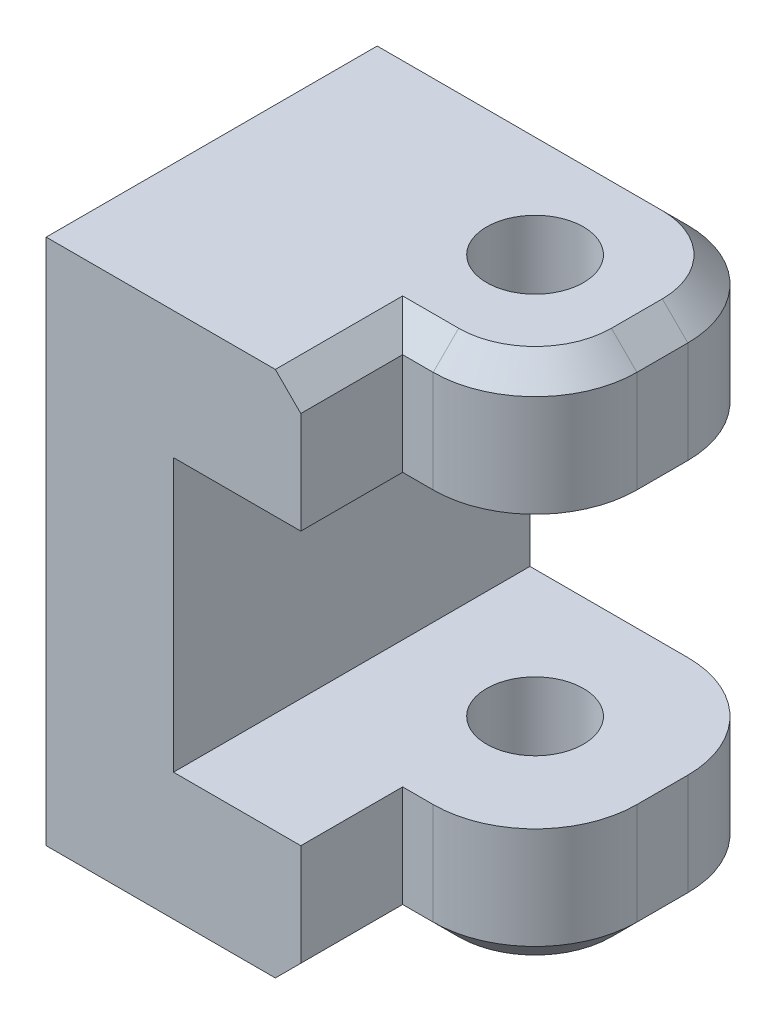
ISO-10303-21;
HEADER;
FILE_DESCRIPTION(('STEP AP214'),'2;1');
FILE_NAME('part.step','',(''),(''),'','','');
FILE_SCHEMA(('AUTOMOTIVE_DESIGN { 1 0 10303 214 1 1 1 1 }'));
ENDSEC;
DATA;
#1=APPLICATION_CONTEXT('core data for automotive mechanical design processes');
#2=APPLICATION_PROTOCOL_DEFINITION('international standard','automotive_design',2000,#1);
#3=PRODUCT_CONTEXT('',#1,'mechanical');
#4=PRODUCT('Part','Part','',(#3));
#5=PRODUCT_RELATED_PRODUCT_CATEGORY('part','',(#4));
#6=PRODUCT_DEFINITION_FORMATION('','',#4);
#7=PRODUCT_DEFINITION_CONTEXT('part definition',#1,'design');
#8=PRODUCT_DEFINITION('design','',#6,#7);
#9=PRODUCT_DEFINITION_SHAPE('','',#8);
#10=(LENGTH_UNIT() NAMED_UNIT(*) SI_UNIT(.MILLI.,.METRE.));
#11=(NAMED_UNIT(*) PLANE_ANGLE_UNIT() SI_UNIT($,.RADIAN.));
#12=(NAMED_UNIT(*) SI_UNIT($,.STERADIAN.) SOLID_ANGLE_UNIT());
#13=UNCERTAINTY_MEASURE_WITH_UNIT(LENGTH_MEASURE(1.E-05),#10,'distance_accuracy_value','');
#14=(GEOMETRIC_REPRESENTATION_CONTEXT(3) GLOBAL_UNCERTAINTY_ASSIGNED_CONTEXT((#13)) GLOBAL_UNIT_ASSIGNED_CONTEXT((#10,
#11,#12)) REPRESENTATION_CONTEXT('',''));
#15=CARTESIAN_POINT('',(0.,0.,0.));
#16=DIRECTION('',(0.,0.,1.));
#17=DIRECTION('',(1.,0.,0.));
#18=AXIS2_PLACEMENT_3D('',#15,#16,#17);
#19=CARTESIAN_POINT('',(24.95,9.35000000000001,0.));
#20=DIRECTION('',(-0.707106781186545,-0.70710678118655,0.));
#21=DIRECTION('',(0.,0.,1.));
#22=AXIS2_PLACEMENT_3D('',#19,#20,#21);
#23=PLANE('',#22);
#24=DIRECTION('',(-0.707106781186547,0.707106781186547,0.));
#25=VECTOR('',#24,1.);
#26=CARTESIAN_POINT('',(24.95,9.35000000000001,4.));
#27=LINE('',#26,#25);
#28=CARTESIAN_POINT('',(24.95,9.35000000000001,4.));
#29=VERTEX_POINT('',#28);
#30=CARTESIAN_POINT('',(23.95,10.35,4.));
#31=VERTEX_POINT('',#30);
#32=EDGE_CURVE('E355',#29,#31,#27,.T.);
#33=ORIENTED_EDGE('',*,*,#32,.T.);
#34=DIRECTION('',(0.,0.,-1.));
#35=VECTOR('',#34,1.);
#36=CARTESIAN_POINT('',(23.95,10.35,5.));
#37=LINE('',#36,#35);
#38=CARTESIAN_POINT('',(23.95,10.35,6.));
#39=VERTEX_POINT('',#38);
#40=EDGE_CURVE('E307',#39,#31,#37,.T.);
#41=ORIENTED_EDGE('',*,*,#40,.F.);
#42=DIRECTION('',(-0.70710678118655,0.707106781186545,0.));
#43=VECTOR('',#42,1.);
#44=CARTESIAN_POINT('',(24.95,9.35000000000001,6.));
#45=LINE('',#44,#43);
#46=CARTESIAN_POINT('',(24.95,9.35000000000001,6.));
#47=VERTEX_POINT('',#46);
#48=EDGE_CURVE('E352',#47,#39,#45,.T.);
#49=ORIENTED_EDGE('',*,*,#48,.F.);
#50=DIRECTION('',(0.,0.,1.));
#51=VECTOR('',#50,1.);
#52=CARTESIAN_POINT('',(24.95,9.35000000000001,0.));
#53=LINE('',#52,#51);
#54=EDGE_CURVE('E316',#29,#47,#53,.T.);
#55=ORIENTED_EDGE('',*,*,#54,.F.);
#56=EDGE_LOOP('',(#33,#41,#49,#55));
#57=FACE_BOUND('',#56,.T.);
#58=ADVANCED_FACE('F35',(#57),#23,.F.);
#59=CARTESIAN_POINT('',(20.95,10.35,6.));
#60=DIRECTION('',(0.,-1.,0.));
#61=DIRECTION('',(0.,0.,-1.));
#62=AXIS2_PLACEMENT_3D('',#59,#60,#61);
#63=CONICAL_SURFACE('',#62,3.00000000000001,0.785398163397448);
#64=ORIENTED_EDGE('',*,*,#48,.T.);
#65=CARTESIAN_POINT('',(20.95,10.35,6.));
#66=DIRECTION('',(0.,-1.,0.));
#67=DIRECTION('',(0.,0.,-1.));
#68=AXIS2_PLACEMENT_3D('',#65,#66,#67);
#69=CIRCLE('',#68,3.00000000000001);
#70=CARTESIAN_POINT('',(20.95,10.35,9.00000000000001));
#71=VERTEX_POINT('',#70);
#72=EDGE_CURVE('E305',#71,#39,#69,.F.);
#73=ORIENTED_EDGE('',*,*,#72,.F.);
#74=DIRECTION('',(0.,0.707106781186547,-0.707106781186547));
#75=VECTOR('',#74,1.);
#76=CARTESIAN_POINT('',(20.95,9.35000000000001,10.));
#77=LINE('',#76,#75);
#78=CARTESIAN_POINT('',(20.95,9.35000000000001,10.));
#79=VERTEX_POINT('',#78);
#80=EDGE_CURVE('E349',#79,#71,#77,.T.);
#81=ORIENTED_EDGE('',*,*,#80,.F.);
#82=CARTESIAN_POINT('',(20.95,9.35000000000001,6.));
#83=DIRECTION('',(0.,-1.,0.));
#84=DIRECTION('',(0.,0.,-1.));
#85=AXIS2_PLACEMENT_3D('',#82,#83,#84);
#86=CIRCLE('',#85,4.);
#87=EDGE_CURVE('E314',#47,#79,#86,.T.);
#88=ORIENTED_EDGE('',*,*,#87,.F.);
#89=EDGE_LOOP('',(#64,#73,#81,#88));
#90=FACE_BOUND('',#89,.T.);
#91=ADVANCED_FACE('F392',(#90),#63,.T.);
#92=CARTESIAN_POINT('',(20.95,-10.35,6.));
#93=DIRECTION('',(0.,1.,0.));
#94=DIRECTION('',(0.,0.,1.));
#95=AXIS2_PLACEMENT_3D('',#92,#93,#94);
#96=CONICAL_SURFACE('',#95,2.99999999999999,0.785398163397452);
#97=DIRECTION('',(0.,-0.707106781186545,-0.70710678118655));
#98=VECTOR('',#97,1.);
#99=CARTESIAN_POINT('',(20.95,-9.35,10.));
#100=LINE('',#99,#98);
#101=CARTESIAN_POINT('',(20.95,-9.35,10.));
#102=VERTEX_POINT('',#101);
#103=CARTESIAN_POINT('',(20.95,-10.35,8.99999999999999));
#104=VERTEX_POINT('',#103);
#105=EDGE_CURVE('E370',#102,#104,#100,.T.);
#106=ORIENTED_EDGE('',*,*,#105,.T.);
#107=CARTESIAN_POINT('',(20.95,-10.35,6.));
#108=DIRECTION('',(0.,1.,0.));
#109=DIRECTION('',(0.,0.,1.));
#110=AXIS2_PLACEMENT_3D('',#107,#108,#109);
#111=CIRCLE('',#110,2.99999999999999);
#112=CARTESIAN_POINT('',(23.95,-10.35,6.));
#113=VERTEX_POINT('',#112);
#114=EDGE_CURVE('E330',#113,#104,#111,.F.);
#115=ORIENTED_EDGE('',*,*,#114,.F.);
#116=DIRECTION('',(-0.70710678118655,-0.707106781186545,0.));
#117=VECTOR('',#116,1.);
#118=CARTESIAN_POINT('',(24.95,-9.35,6.));
#119=LINE('',#118,#117);
#120=CARTESIAN_POINT('',(24.95,-9.35,6.));
#121=VERTEX_POINT('',#120);
#122=EDGE_CURVE('E367',#121,#113,#119,.T.);
#123=ORIENTED_EDGE('',*,*,#122,.F.);
#124=CARTESIAN_POINT('',(20.95,-9.35,6.));
#125=DIRECTION('',(0.,1.,0.));
#126=DIRECTION('',(0.,0.,1.));
#127=AXIS2_PLACEMENT_3D('',#124,#125,#126);
#128=CIRCLE('',#127,4.);
#129=EDGE_CURVE('E340',#102,#121,#128,.T.);
#130=ORIENTED_EDGE('',*,*,#129,.F.);
#131=EDGE_LOOP('',(#106,#115,#123,#130));
#132=FACE_BOUND('',#131,.T.);
#133=ADVANCED_FACE('F463',(#132),#96,.T.);
#134=CARTESIAN_POINT('',(24.95,-9.35,0.));
#135=DIRECTION('',(0.707106781186546,-0.707106781186549,0.));
#136=DIRECTION('',(0.,0.,1.));
#137=AXIS2_PLACEMENT_3D('',#134,#135,#136);
#138=PLANE('',#137);
#139=ORIENTED_EDGE('',*,*,#122,.T.);
#140=DIRECTION('',(0.,0.,1.));
#141=VECTOR('',#140,1.);
#142=CARTESIAN_POINT('',(23.95,-10.35,6.));
#143=LINE('',#142,#141);
#144=CARTESIAN_POINT('',(23.95,-10.35,4.));
#145=VERTEX_POINT('',#144);
#146=EDGE_CURVE('E332',#145,#113,#143,.T.);
#147=ORIENTED_EDGE('',*,*,#146,.F.);
#148=DIRECTION('',(-0.707106781186549,-0.707106781186546,0.));
#149=VECTOR('',#148,1.);
#150=CARTESIAN_POINT('',(24.95,-9.35,4.));
#151=LINE('',#150,#149);
#152=CARTESIAN_POINT('',(24.95,-9.35,4.));
#153=VERTEX_POINT('',#152);
#154=EDGE_CURVE('E364',#153,#145,#151,.T.);
#155=ORIENTED_EDGE('',*,*,#154,.F.);
#156=DIRECTION('',(0.,0.,-1.));
#157=VECTOR('',#156,1.);
#158=CARTESIAN_POINT('',(24.95,-9.35,4.));
#159=LINE('',#158,#157);
#160=EDGE_CURVE('E59',#121,#153,#159,.T.);
#161=ORIENTED_EDGE('',*,*,#160,.F.);
#162=EDGE_LOOP('',(#139,#147,#155,#161));
#163=FACE_BOUND('',#162,.T.);
#164=ADVANCED_FACE('F456',(#163),#138,.T.);
#165=CARTESIAN_POINT('',(20.95,0.,6.));
#166=DIRECTION('',(0.,-1.,0.));
#167=DIRECTION('',(1.,0.,0.));
#168=AXIS2_PLACEMENT_3D('',#165,#166,#167);
#169=CYLINDRICAL_SURFACE('',#168,4.);
#170=DIRECTION('',(0.,-1.,0.));
#171=VECTOR('',#170,1.);
#172=CARTESIAN_POINT('',(24.95,0.,6.));
#173=LINE('',#172,#171);
#174=CARTESIAN_POINT('',(24.95,5.35,6.));
#175=VERTEX_POINT('',#174);
#176=EDGE_CURVE('E274',#47,#175,#173,.T.);
#177=ORIENTED_EDGE('',*,*,#176,.F.);
#178=ORIENTED_EDGE('',*,*,#87,.T.);
#179=DIRECTION('',(0.,-1.,0.));
#180=VECTOR('',#179,1.);
#181=CARTESIAN_POINT('',(20.95,10.35,10.));
#182=LINE('',#181,#180);
#183=CARTESIAN_POINT('',(20.95,5.35,10.));
#184=VERTEX_POINT('',#183);
#185=EDGE_CURVE('E280',#184,#79,#182,.F.);
#186=ORIENTED_EDGE('',*,*,#185,.F.);
#187=CARTESIAN_POINT('',(20.95,5.35,6.));
#188=DIRECTION('',(0.,1.,0.));
#189=DIRECTION('',(0.,0.,1.));
#190=AXIS2_PLACEMENT_3D('',#187,#188,#189);
#191=CIRCLE('',#190,4.);
#192=EDGE_CURVE('E278',#175,#184,#191,.F.);
#193=ORIENTED_EDGE('',*,*,#192,.F.);
#194=EDGE_LOOP('',(#177,#178,#186,#193));
#195=FACE_BOUND('',#194,.T.);
#196=ADVANCED_FACE('F454',(#195),#169,.T.);
#197=CARTESIAN_POINT('',(24.95,0.,0.));
#198=DIRECTION('',(-1.,0.,0.));
#199=DIRECTION('',(0.,-1.,0.));
#200=AXIS2_PLACEMENT_3D('',#197,#198,#199);
#201=PLANE('',#200);
#202=DIRECTION('',(0.,1.,0.));
#203=VECTOR('',#202,1.);
#204=CARTESIAN_POINT('',(24.95,0.,4.));
#205=LINE('',#204,#203);
#206=CARTESIAN_POINT('',(24.95,5.35,4.));
#207=VERTEX_POINT('',#206);
#208=EDGE_CURVE('E269',#207,#29,#205,.T.);
#209=ORIENTED_EDGE('',*,*,#208,.T.);
#210=ORIENTED_EDGE('',*,*,#54,.T.);
#211=ORIENTED_EDGE('',*,*,#176,.T.);
#212=DIRECTION('',(0.,0.,-1.));
#213=VECTOR('',#212,1.);
#214=CARTESIAN_POINT('',(24.95,5.35,0.));
#215=LINE('',#214,#213);
#216=EDGE_CURVE('E256',#175,#207,#215,.T.);
#217=ORIENTED_EDGE('',*,*,#216,.T.);
#218=EDGE_LOOP('',(#209,#210,#211,#217));
#219=FACE_BOUND('',#218,.T.);
#220=ADVANCED_FACE('F448',(#219),#201,.F.);
#221=CARTESIAN_POINT('',(20.95,0.,4.));
#222=DIRECTION('',(0.,1.,0.));
#223=DIRECTION('',(-1.,0.,0.));
#224=AXIS2_PLACEMENT_3D('',#221,#222,#223);
#225=CYLINDRICAL_SURFACE('',#224,4.);
#226=DIRECTION('',(0.,1.,0.));
#227=VECTOR('',#226,1.);
#228=CARTESIAN_POINT('',(20.95,0.,0.));
#229=LINE('',#228,#227);
#230=CARTESIAN_POINT('',(20.95,9.35000000000001,0.));
#231=VERTEX_POINT('',#230);
#232=CARTESIAN_POINT('',(20.95,5.35,0.));
#233=VERTEX_POINT('',#232);
#234=EDGE_CURVE('E286',#231,#233,#229,.F.);
#235=ORIENTED_EDGE('',*,*,#234,.F.);
#236=CARTESIAN_POINT('',(20.95,9.35000000000001,4.));
#237=DIRECTION('',(0.,-1.,0.));
#238=DIRECTION('',(0.,0.,-1.));
#239=AXIS2_PLACEMENT_3D('',#236,#237,#238);
#240=CIRCLE('',#239,4.);
#241=EDGE_CURVE('E318',#231,#29,#240,.T.);
#242=ORIENTED_EDGE('',*,*,#241,.T.);
#243=ORIENTED_EDGE('',*,*,#208,.F.);
#244=CARTESIAN_POINT('',(20.95,5.35,4.));
#245=DIRECTION('',(0.,1.,0.));
#246=DIRECTION('',(0.,0.,1.));
#247=AXIS2_PLACEMENT_3D('',#244,#245,#246);
#248=CIRCLE('',#247,4.);
#249=EDGE_CURVE('E276',#233,#207,#248,.F.);
#250=ORIENTED_EDGE('',*,*,#249,.F.);
#251=EDGE_LOOP('',(#235,#242,#243,#250));
#252=FACE_BOUND('',#251,.T.);
#253=ADVANCED_FACE('F446',(#252),#225,.T.);
#254=CARTESIAN_POINT('',(19.95,10.35,5.));
#255=DIRECTION('',(0.,-1.,0.));
#256=DIRECTION('',(0.,0.,-1.));
#257=AXIS2_PLACEMENT_3D('',#254,#255,#256);
#258=CYLINDRICAL_SURFACE('',#257,1.9);
#259=CARTESIAN_POINT('',(19.95,10.35,5.));
#260=DIRECTION('',(0.,-1.,0.));
#261=DIRECTION('',(0.,0.,-1.));
#262=AXIS2_PLACEMENT_3D('',#259,#260,#261);
#263=CIRCLE('',#262,1.9);
#264=CARTESIAN_POINT('',(19.95,10.35,3.1));
#265=VERTEX_POINT('',#264);
#266=EDGE_CURVE('E235',#265,#265,#263,.T.);
#267=ORIENTED_EDGE('',*,*,#266,.F.);
#268=EDGE_LOOP('',(#267));
#269=FACE_BOUND('',#268,.T.);
#270=CARTESIAN_POINT('',(19.95,5.35,5.));
#271=DIRECTION('',(0.,1.,0.));
#272=DIRECTION('',(0.,0.,1.));
#273=AXIS2_PLACEMENT_3D('',#270,#271,#272);
#274=CIRCLE('',#273,1.9);
#275=CARTESIAN_POINT('',(19.95,5.35,6.9));
#276=VERTEX_POINT('',#275);
#277=EDGE_CURVE('E241',#276,#276,#274,.T.);
#278=ORIENTED_EDGE('',*,*,#277,.F.);
#279=EDGE_LOOP('',(#278));
#280=FACE_BOUND('',#279,.T.);
#281=ADVANCED_FACE('F560',(#269,#280),#258,.F.);
#282=CARTESIAN_POINT('',(20.95,0.,4.));
#283=DIRECTION('',(0.,-1.,0.));
#284=DIRECTION('',(1.,0.,0.));
#285=AXIS2_PLACEMENT_3D('',#282,#283,#284);
#286=CYLINDRICAL_SURFACE('',#285,4.);
#287=DIRECTION('',(0.,1.,0.));
#288=VECTOR('',#287,1.);
#289=CARTESIAN_POINT('',(24.95,-5.35,4.));
#290=LINE('',#289,#288);
#291=CARTESIAN_POINT('',(24.95,-5.35,4.));
#292=VERTEX_POINT('',#291);
#293=EDGE_CURVE('E290',#153,#292,#290,.T.);
#294=ORIENTED_EDGE('',*,*,#293,.F.);
#295=CARTESIAN_POINT('',(20.95,-9.35,4.));
#296=DIRECTION('',(0.,1.,0.));
#297=DIRECTION('',(0.,0.,1.));
#298=AXIS2_PLACEMENT_3D('',#295,#296,#297);
#299=CIRCLE('',#298,4.);
#300=CARTESIAN_POINT('',(20.95,-9.35,0.));
#301=VERTEX_POINT('',#300);
#302=EDGE_CURVE('E342',#153,#301,#299,.T.);
#303=ORIENTED_EDGE('',*,*,#302,.T.);
#304=DIRECTION('',(0.,1.,0.));
#305=VECTOR('',#304,1.);
#306=CARTESIAN_POINT('',(20.95,-10.35,0.));
#307=LINE('',#306,#305);
#308=CARTESIAN_POINT('',(20.95,-5.35,0.));
#309=VERTEX_POINT('',#308);
#310=EDGE_CURVE('E283',#309,#301,#307,.F.);
#311=ORIENTED_EDGE('',*,*,#310,.F.);
#312=CARTESIAN_POINT('',(20.95,-5.35,4.));
#313=DIRECTION('',(0.,-1.,0.));
#314=DIRECTION('',(0.,0.,-1.));
#315=AXIS2_PLACEMENT_3D('',#312,#313,#314);
#316=CIRCLE('',#315,4.);
#317=EDGE_CURVE('E294',#292,#309,#316,.F.);
#318=ORIENTED_EDGE('',*,*,#317,.F.);
#319=EDGE_LOOP('',(#294,#303,#311,#318));
#320=FACE_BOUND('',#319,.T.);
#321=ADVANCED_FACE('F548',(#320),#286,.T.);
#322=CARTESIAN_POINT('',(24.95,0.,0.));
#323=DIRECTION('',(1.,0.,0.));
#324=DIRECTION('',(0.,1.,0.));
#325=AXIS2_PLACEMENT_3D('',#322,#323,#324);
#326=PLANE('',#325);
#327=DIRECTION('',(0.,-1.,0.));
#328=VECTOR('',#327,1.);
#329=CARTESIAN_POINT('',(24.95,-10.35,6.));
#330=LINE('',#329,#328);
#331=CARTESIAN_POINT('',(24.95,-5.35,6.));
#332=VERTEX_POINT('',#331);
#333=EDGE_CURVE('E288',#332,#121,#330,.T.);
#334=ORIENTED_EDGE('',*,*,#333,.T.);
#335=ORIENTED_EDGE('',*,*,#160,.T.);
#336=ORIENTED_EDGE('',*,*,#293,.T.);
#337=DIRECTION('',(0.,0.,1.));
#338=VECTOR('',#337,1.);
#339=CARTESIAN_POINT('',(24.95,-5.35,0.));
#340=LINE('',#339,#338);
#341=EDGE_CURVE('E245',#292,#332,#340,.T.);
#342=ORIENTED_EDGE('',*,*,#341,.T.);
#343=EDGE_LOOP('',(#334,#335,#336,#342));
#344=FACE_BOUND('',#343,.T.);
#345=ADVANCED_FACE('F551',(#344),#326,.T.);
#346=CARTESIAN_POINT('',(20.95,0.,6.));
#347=DIRECTION('',(0.,1.,0.));
#348=DIRECTION('',(-1.,0.,0.));
#349=AXIS2_PLACEMENT_3D('',#346,#347,#348);
#350=CYLINDRICAL_SURFACE('',#349,4.);
#351=DIRECTION('',(0.,-1.,0.));
#352=VECTOR('',#351,1.);
#353=CARTESIAN_POINT('',(20.95,-5.35,10.));
#354=LINE('',#353,#352);
#355=CARTESIAN_POINT('',(20.95,-5.35,10.));
#356=VERTEX_POINT('',#355);
#357=EDGE_CURVE('E296',#102,#356,#354,.F.);
#358=ORIENTED_EDGE('',*,*,#357,.F.);
#359=ORIENTED_EDGE('',*,*,#129,.T.);
#360=ORIENTED_EDGE('',*,*,#333,.F.);
#361=CARTESIAN_POINT('',(20.95,-5.35,6.));
#362=DIRECTION('',(0.,-1.,0.));
#363=DIRECTION('',(0.,0.,-1.));
#364=AXIS2_PLACEMENT_3D('',#361,#362,#363);
#365=CIRCLE('',#364,4.);
#366=EDGE_CURVE('E292',#356,#332,#365,.F.);
#367=ORIENTED_EDGE('',*,*,#366,.F.);
#368=EDGE_LOOP('',(#358,#359,#360,#367));
#369=FACE_BOUND('',#368,.T.);
#370=ADVANCED_FACE('F539',(#369),#350,.T.);
#371=CARTESIAN_POINT('',(19.95,-10.35,5.));
#372=DIRECTION('',(0.,-1.,0.));
#373=DIRECTION('',(0.,0.,-1.));
#374=AXIS2_PLACEMENT_3D('',#371,#372,#373);
#375=CIRCLE('',#374,1.9);
#376=CARTESIAN_POINT('',(19.95,-10.35,3.1));
#377=VERTEX_POINT('',#376);
#378=EDGE_CURVE('E234',#377,#377,#375,.T.);
#379=ORIENTED_EDGE('',*,*,#378,.T.);
#380=EDGE_LOOP('',(#379));
#381=FACE_BOUND('',#380,.T.);
#382=CARTESIAN_POINT('',(19.95,-5.35,5.));
#383=DIRECTION('',(0.,-1.,0.));
#384=DIRECTION('',(0.,0.,-1.));
#385=AXIS2_PLACEMENT_3D('',#382,#383,#384);
#386=CIRCLE('',#385,1.9);
#387=CARTESIAN_POINT('',(19.95,-5.35,3.1));
#388=VERTEX_POINT('',#387);
#389=EDGE_CURVE('E238',#388,#388,#386,.T.);
#390=ORIENTED_EDGE('',*,*,#389,.F.);
#391=EDGE_LOOP('',(#390));
#392=FACE_BOUND('',#391,.T.);
#393=ADVANCED_FACE('F558',(#381,#392),#258,.F.);
#394=CARTESIAN_POINT('',(24.95,10.35,10.));
#395=DIRECTION('',(0.,0.,-1.));
#396=DIRECTION('',(-1.,0.,0.));
#397=AXIS2_PLACEMENT_3D('',#394,#395,#396);
#398=PLANE('',#397);
#399=ORIENTED_EDGE('',*,*,#185,.T.);
#400=DIRECTION('',(-1.,0.,0.));
#401=VECTOR('',#400,1.);
#402=CARTESIAN_POINT('',(24.95,9.35000000000001,10.));
#403=LINE('',#402,#401);
#404=CARTESIAN_POINT('',(19.75,9.35000000000001,10.));
#405=VERTEX_POINT('',#404);
#406=EDGE_CURVE('E312',#79,#405,#403,.T.);
#407=ORIENTED_EDGE('',*,*,#406,.T.);
#408=DIRECTION('',(0.,1.,0.));
#409=VECTOR('',#408,1.);
#410=CARTESIAN_POINT('',(19.75,10.35,10.));
#411=LINE('',#410,#409);
#412=CARTESIAN_POINT('',(19.75,5.35,10.));
#413=VERTEX_POINT('',#412);
#414=EDGE_CURVE('E231',#413,#405,#411,.T.);
#415=ORIENTED_EDGE('',*,*,#414,.F.);
#416=DIRECTION('',(-1.,0.,0.));
#417=VECTOR('',#416,1.);
#418=CARTESIAN_POINT('',(24.95,5.35,10.));
#419=LINE('',#418,#417);
#420=EDGE_CURVE('E263',#184,#413,#419,.T.);
#421=ORIENTED_EDGE('',*,*,#420,.F.);
#422=EDGE_LOOP('',(#399,#407,#415,#421));
#423=FACE_BOUND('',#422,.T.);
#424=ADVANCED_FACE('F453',(#423),#398,.F.);
#425=CARTESIAN_POINT('',(24.95,-10.35,10.));
#426=DIRECTION('',(0.,0.,-1.));
#427=DIRECTION('',(-1.,0.,0.));
#428=AXIS2_PLACEMENT_3D('',#425,#426,#427);
#429=PLANE('',#428);
#430=DIRECTION('',(0.,1.,0.));
#431=VECTOR('',#430,1.);
#432=CARTESIAN_POINT('',(19.75,-5.35,10.));
#433=LINE('',#432,#431);
#434=CARTESIAN_POINT('',(19.75,-9.35,10.));
#435=VERTEX_POINT('',#434);
#436=CARTESIAN_POINT('',(19.75,-5.35,10.));
#437=VERTEX_POINT('',#436);
#438=EDGE_CURVE('E223',#435,#437,#433,.T.);
#439=ORIENTED_EDGE('',*,*,#438,.F.);
#440=DIRECTION('',(1.,0.,0.));
#441=VECTOR('',#440,1.);
#442=CARTESIAN_POINT('',(24.95,-9.35,10.));
#443=LINE('',#442,#441);
#444=EDGE_CURVE('E338',#435,#102,#443,.T.);
#445=ORIENTED_EDGE('',*,*,#444,.T.);
#446=ORIENTED_EDGE('',*,*,#357,.T.);
#447=DIRECTION('',(-1.,0.,0.));
#448=VECTOR('',#447,1.);
#449=CARTESIAN_POINT('',(24.95,-5.35,10.));
#450=LINE('',#449,#448);
#451=EDGE_CURVE('E248',#356,#437,#450,.T.);
#452=ORIENTED_EDGE('',*,*,#451,.T.);
#453=EDGE_LOOP('',(#439,#445,#446,#452));
#454=FACE_BOUND('',#453,.T.);
#455=ADVANCED_FACE('F515',(#454),#429,.F.);
#456=CARTESIAN_POINT('',(-14.75,-10.35,8.99999999999999));
#457=DIRECTION('',(0.,0.70710678118655,-0.707106781186545));
#458=DIRECTION('',(-1.,0.,0.));
#459=AXIS2_PLACEMENT_3D('',#456,#457,#458);
#460=PLANE('',#459);
#461=DIRECTION('',(-0.577350269189626,-0.577350269189624,-0.577350269189628));
#462=VECTOR('',#461,1.);
#463=CARTESIAN_POINT('',(7.58333333333334,-21.5166666666666,-2.16666666666671));
#464=LINE('',#463,#462);
#465=CARTESIAN_POINT('',(18.75,-10.35,8.99999999999999));
#466=VERTEX_POINT('',#465);
#467=EDGE_CURVE('E226',#435,#466,#464,.T.);
#468=ORIENTED_EDGE('',*,*,#467,.T.);
#469=DIRECTION('',(-1.,0.,0.));
#470=VECTOR('',#469,1.);
#471=CARTESIAN_POINT('',(-14.75,-10.35,8.99999999999999));
#472=LINE('',#471,#470);
#473=EDGE_CURVE('E328',#104,#466,#472,.T.);
#474=ORIENTED_EDGE('',*,*,#473,.F.);
#475=ORIENTED_EDGE('',*,*,#105,.F.);
#476=ORIENTED_EDGE('',*,*,#444,.F.);
#477=EDGE_LOOP('',(#468,#474,#475,#476));
#478=FACE_BOUND('',#477,.T.);
#479=ADVANCED_FACE('F501',(#478),#460,.F.);
#480=CARTESIAN_POINT('',(20.95,-10.35,4.));
#481=DIRECTION('',(0.,1.,0.));
#482=DIRECTION('',(0.,0.,1.));
#483=AXIS2_PLACEMENT_3D('',#480,#481,#482);
#484=CONICAL_SURFACE('',#483,2.99999999999999,0.785398163397452);
#485=ORIENTED_EDGE('',*,*,#154,.T.);
#486=CARTESIAN_POINT('',(20.95,-10.35,4.));
#487=DIRECTION('',(0.,1.,0.));
#488=DIRECTION('',(0.,0.,1.));
#489=AXIS2_PLACEMENT_3D('',#486,#487,#488);
#490=CIRCLE('',#489,2.99999999999999);
#491=CARTESIAN_POINT('',(20.95,-10.35,1.00000000000001));
#492=VERTEX_POINT('',#491);
#493=EDGE_CURVE('E334',#492,#145,#490,.F.);
#494=ORIENTED_EDGE('',*,*,#493,.F.);
#495=DIRECTION('',(0.,-0.707106781186545,0.70710678118655));
#496=VECTOR('',#495,1.);
#497=CARTESIAN_POINT('',(20.95,-9.35,0.));
#498=LINE('',#497,#496);
#499=EDGE_CURVE('E361',#301,#492,#498,.T.);
#500=ORIENTED_EDGE('',*,*,#499,.F.);
#501=ORIENTED_EDGE('',*,*,#302,.F.);
#502=EDGE_LOOP('',(#485,#494,#500,#501));
#503=FACE_BOUND('',#502,.T.);
#504=ADVANCED_FACE('F486',(#503),#484,.T.);
#505=CARTESIAN_POINT('',(20.95,10.35,4.));
#506=DIRECTION('',(0.,-1.,0.));
#507=DIRECTION('',(0.,0.,-1.));
#508=AXIS2_PLACEMENT_3D('',#505,#506,#507);
#509=CONICAL_SURFACE('',#508,3.00000000000001,0.785398163397448);
#510=DIRECTION('',(0.,0.707106781186547,0.707106781186547));
#511=VECTOR('',#510,1.);
#512=CARTESIAN_POINT('',(20.95,9.35000000000001,0.));
#513=LINE('',#512,#511);
#514=CARTESIAN_POINT('',(20.95,10.35,0.999999999999994));
#515=VERTEX_POINT('',#514);
#516=EDGE_CURVE('E358',#231,#515,#513,.T.);
#517=ORIENTED_EDGE('',*,*,#516,.T.);
#518=CARTESIAN_POINT('',(20.95,10.35,4.));
#519=DIRECTION('',(0.,-1.,0.));
#520=DIRECTION('',(0.,0.,-1.));
#521=AXIS2_PLACEMENT_3D('',#518,#519,#520);
#522=CIRCLE('',#521,3.00000000000001);
#523=EDGE_CURVE('E309',#31,#515,#522,.F.);
#524=ORIENTED_EDGE('',*,*,#523,.F.);
#525=ORIENTED_EDGE('',*,*,#32,.F.);
#526=ORIENTED_EDGE('',*,*,#241,.F.);
#527=EDGE_LOOP('',(#517,#524,#525,#526));
#528=FACE_BOUND('',#527,.T.);
#529=ADVANCED_FACE('F400',(#528),#509,.T.);
#530=CARTESIAN_POINT('',(24.95,9.35000000000001,10.));
#531=DIRECTION('',(0.,-0.707106781186547,-0.707106781186547));
#532=DIRECTION('',(-1.,0.,0.));
#533=AXIS2_PLACEMENT_3D('',#530,#531,#532);
#534=PLANE('',#533);
#535=ORIENTED_EDGE('',*,*,#80,.T.);
#536=DIRECTION('',(1.,0.,0.));
#537=VECTOR('',#536,1.);
#538=CARTESIAN_POINT('',(-14.75,10.35,9.00000000000001));
#539=LINE('',#538,#537);
#540=CARTESIAN_POINT('',(18.75,10.35,9.00000000000001));
#541=VERTEX_POINT('',#540);
#542=EDGE_CURVE('E303',#541,#71,#539,.T.);
#543=ORIENTED_EDGE('',*,*,#542,.F.);
#544=DIRECTION('',(-0.57735026918963,0.577350269189624,-0.577350269189624));
#545=VECTOR('',#544,1.);
#546=CARTESIAN_POINT('',(16.4166666666667,12.6833333333333,6.66666666666669));
#547=LINE('',#546,#545);
#548=EDGE_CURVE('E222',#405,#541,#547,.T.);
#549=ORIENTED_EDGE('',*,*,#548,.F.);
#550=ORIENTED_EDGE('',*,*,#406,.F.);
#551=EDGE_LOOP('',(#535,#543,#549,#550));
#552=FACE_BOUND('',#551,.T.);
#553=ADVANCED_FACE('F387',(#552),#534,.F.);
#554=CARTESIAN_POINT('',(-14.75,-10.35,1.00000000000001));
#555=DIRECTION('',(0.,0.70710678118655,0.707106781186545));
#556=DIRECTION('',(1.,0.,0.));
#557=AXIS2_PLACEMENT_3D('',#554,#555,#556);
#558=PLANE('',#557);
#559=DIRECTION('',(1.,0.,0.));
#560=VECTOR('',#559,1.);
#561=CARTESIAN_POINT('',(-14.75,-10.35,1.00000000000001));
#562=LINE('',#561,#560);
#563=CARTESIAN_POINT('',(9.74999999999999,-10.35,1.00000000000001));
#564=VERTEX_POINT('',#563);
#565=EDGE_CURVE('E336',#564,#492,#562,.T.);
#566=ORIENTED_EDGE('',*,*,#565,.F.);
#567=DIRECTION('',(0.,-0.707106781186545,0.70710678118655));
#568=VECTOR('',#567,1.);
#569=CARTESIAN_POINT('',(9.74999999999999,-10.35,1.00000000000001));
#570=LINE('',#569,#568);
#571=CARTESIAN_POINT('',(9.74999999999999,-9.35,0.));
#572=VERTEX_POINT('',#571);
#573=EDGE_CURVE('E212',#564,#572,#570,.F.);
#574=ORIENTED_EDGE('',*,*,#573,.T.);
#575=DIRECTION('',(-1.,0.,0.));
#576=VECTOR('',#575,1.);
#577=CARTESIAN_POINT('',(0.,-9.35,0.));
#578=LINE('',#577,#576);
#579=EDGE_CURVE('E320',#301,#572,#578,.T.);
#580=ORIENTED_EDGE('',*,*,#579,.F.);
#581=ORIENTED_EDGE('',*,*,#499,.T.);
#582=EDGE_LOOP('',(#566,#574,#580,#581));
#583=FACE_BOUND('',#582,.T.);
#584=ADVANCED_FACE('F416',(#583),#558,.F.);
#585=CARTESIAN_POINT('',(19.75,-9.35,0.));
#586=DIRECTION('',(0.707106781186546,-0.707106781186549,0.));
#587=DIRECTION('',(0.,0.,1.));
#588=AXIS2_PLACEMENT_3D('',#585,#586,#587);
#589=PLANE('',#588);
#590=DIRECTION('',(0.,0.,-1.));
#591=VECTOR('',#590,1.);
#592=CARTESIAN_POINT('',(19.75,-9.35,10.));
#593=LINE('',#592,#591);
#594=CARTESIAN_POINT('',(19.75,-9.35,14.));
#595=VERTEX_POINT('',#594);
#596=EDGE_CURVE('E345',#595,#435,#593,.T.);
#597=ORIENTED_EDGE('',*,*,#596,.F.);
#598=DIRECTION('',(-0.707106781186549,-0.707106781186546,0.));
#599=VECTOR('',#598,1.);
#600=CARTESIAN_POINT('',(19.75,-9.35,14.));
#601=LINE('',#600,#599);
#602=CARTESIAN_POINT('',(18.75,-10.35,14.));
#603=VERTEX_POINT('',#602);
#604=EDGE_CURVE('E422',#595,#603,#601,.T.);
#605=ORIENTED_EDGE('',*,*,#604,.T.);
#606=DIRECTION('',(0.,0.,1.));
#607=VECTOR('',#606,1.);
#608=CARTESIAN_POINT('',(18.75,-10.35,34.));
#609=LINE('',#608,#607);
#610=EDGE_CURVE('E325',#466,#603,#609,.T.);
#611=ORIENTED_EDGE('',*,*,#610,.F.);
#612=ORIENTED_EDGE('',*,*,#467,.F.);
#613=EDGE_LOOP('',(#597,#605,#611,#612));
#614=FACE_BOUND('',#613,.T.);
#615=ADVANCED_FACE('F38',(#614),#589,.T.);
#616=CARTESIAN_POINT('',(19.75,0.,0.));
#617=DIRECTION('',(1.,0.,0.));
#618=DIRECTION('',(0.,1.,0.));
#619=AXIS2_PLACEMENT_3D('',#616,#617,#618);
#620=PLANE('',#619);
#621=DIRECTION('',(0.,0.,1.));
#622=VECTOR('',#621,1.);
#623=CARTESIAN_POINT('',(19.75,-5.35,34.));
#624=LINE('',#623,#622);
#625=CARTESIAN_POINT('',(19.75,-5.35,14.));
#626=VERTEX_POINT('',#625);
#627=EDGE_CURVE('E225',#437,#626,#624,.T.);
#628=ORIENTED_EDGE('',*,*,#627,.T.);
#629=DIRECTION('',(0.,-1.,0.));
#630=VECTOR('',#629,1.);
#631=CARTESIAN_POINT('',(19.75,0.,14.));
#632=LINE('',#631,#630);
#633=EDGE_CURVE('E423',#626,#595,#632,.T.);
#634=ORIENTED_EDGE('',*,*,#633,.T.);
#635=ORIENTED_EDGE('',*,*,#596,.T.);
#636=ORIENTED_EDGE('',*,*,#438,.T.);
#637=EDGE_LOOP('',(#628,#634,#635,#636));
#638=FACE_BOUND('',#637,.T.);
#639=ADVANCED_FACE('F530',(#638),#620,.T.);
#640=CARTESIAN_POINT('',(24.95,-5.35,0.));
#641=DIRECTION('',(0.,-1.,0.));
#642=DIRECTION('',(0.,0.,-1.));
#643=AXIS2_PLACEMENT_3D('',#640,#641,#642);
#644=PLANE('',#643);
#645=ORIENTED_EDGE('',*,*,#389,.T.);
#646=EDGE_LOOP('',(#645));
#647=FACE_BOUND('',#646,.T.);
#648=DIRECTION('',(-1.,0.,0.));
#649=VECTOR('',#648,1.);
#650=CARTESIAN_POINT('',(24.95,-5.35,14.));
#651=LINE('',#650,#649);
#652=CARTESIAN_POINT('',(14.75,-5.35000000000001,14.));
#653=VERTEX_POINT('',#652);
#654=EDGE_CURVE('E428',#626,#653,#651,.T.);
#655=ORIENTED_EDGE('',*,*,#654,.F.);
#656=ORIENTED_EDGE('',*,*,#627,.F.);
#657=ORIENTED_EDGE('',*,*,#451,.F.);
#658=ORIENTED_EDGE('',*,*,#366,.T.);
#659=ORIENTED_EDGE('',*,*,#341,.F.);
#660=ORIENTED_EDGE('',*,*,#317,.T.);
#661=DIRECTION('',(-1.,0.,0.));
#662=VECTOR('',#661,1.);
#663=CARTESIAN_POINT('',(24.95,-5.35,0.));
#664=LINE('',#663,#662);
#665=CARTESIAN_POINT('',(14.75,-5.35,0.));
#666=VERTEX_POINT('',#665);
#667=EDGE_CURVE('E253',#309,#666,#664,.T.);
#668=ORIENTED_EDGE('',*,*,#667,.T.);
#669=DIRECTION('',(0.,0.,1.));
#670=VECTOR('',#669,1.);
#671=CARTESIAN_POINT('',(14.75,-5.35,0.));
#672=LINE('',#671,#670);
#673=EDGE_CURVE('E244',#666,#653,#672,.T.);
#674=ORIENTED_EDGE('',*,*,#673,.T.);
#675=EDGE_LOOP('',(#655,#656,#657,#658,#659,#660,#668,#674));
#676=FACE_BOUND('',#675,.T.);
#677=ADVANCED_FACE('F535',(#647,#676),#644,.F.);
#678=CARTESIAN_POINT('',(19.75,9.35,0.));
#679=DIRECTION('',(0.707106781186544,0.707106781186551,0.));
#680=DIRECTION('',(0.,0.,-1.));
#681=AXIS2_PLACEMENT_3D('',#678,#679,#680);
#682=PLANE('',#681);
#683=DIRECTION('',(0.,0.,-1.));
#684=VECTOR('',#683,1.);
#685=CARTESIAN_POINT('',(18.75,10.35,10.));
#686=LINE('',#685,#684);
#687=CARTESIAN_POINT('',(18.75,10.35,14.));
#688=VERTEX_POINT('',#687);
#689=EDGE_CURVE('E301',#688,#541,#686,.T.);
#690=ORIENTED_EDGE('',*,*,#689,.F.);
#691=DIRECTION('',(0.707106781186551,-0.707106781186544,0.));
#692=VECTOR('',#691,1.);
#693=CARTESIAN_POINT('',(19.75,9.35,14.));
#694=LINE('',#693,#692);
#695=CARTESIAN_POINT('',(19.75,9.35,14.));
#696=VERTEX_POINT('',#695);
#697=EDGE_CURVE('E44',#688,#696,#694,.T.);
#698=ORIENTED_EDGE('',*,*,#697,.T.);
#699=DIRECTION('',(0.,0.,1.));
#700=VECTOR('',#699,1.);
#701=CARTESIAN_POINT('',(19.75,9.35,34.));
#702=LINE('',#701,#700);
#703=EDGE_CURVE('E298',#405,#696,#702,.T.);
#704=ORIENTED_EDGE('',*,*,#703,.F.);
#705=ORIENTED_EDGE('',*,*,#548,.T.);
#706=EDGE_LOOP('',(#690,#698,#704,#705));
#707=FACE_BOUND('',#706,.T.);
#708=ADVANCED_FACE('F376',(#707),#682,.T.);
#709=CARTESIAN_POINT('',(19.75,0.,0.));
#710=DIRECTION('',(1.,0.,0.));
#711=DIRECTION('',(0.,1.,0.));
#712=AXIS2_PLACEMENT_3D('',#709,#710,#711);
#713=PLANE('',#712);
#714=ORIENTED_EDGE('',*,*,#703,.T.);
#715=DIRECTION('',(0.,-1.,0.));
#716=VECTOR('',#715,1.);
#717=CARTESIAN_POINT('',(19.75,0.,14.));
#718=LINE('',#717,#716);
#719=CARTESIAN_POINT('',(19.75,5.35,14.));
#720=VERTEX_POINT('',#719);
#721=EDGE_CURVE('E51',#696,#720,#718,.T.);
#722=ORIENTED_EDGE('',*,*,#721,.T.);
#723=DIRECTION('',(0.,0.,-1.));
#724=VECTOR('',#723,1.);
#725=CARTESIAN_POINT('',(19.75,5.35,34.));
#726=LINE('',#725,#724);
#727=EDGE_CURVE('E229',#720,#413,#726,.T.);
#728=ORIENTED_EDGE('',*,*,#727,.T.);
#729=ORIENTED_EDGE('',*,*,#414,.T.);
#730=EDGE_LOOP('',(#714,#722,#728,#729));
#731=FACE_BOUND('',#730,.T.);
#732=ADVANCED_FACE('F378',(#731),#713,.T.);
#733=CARTESIAN_POINT('',(24.95,5.35,0.));
#734=DIRECTION('',(0.,1.,0.));
#735=DIRECTION('',(0.,0.,1.));
#736=AXIS2_PLACEMENT_3D('',#733,#734,#735);
#737=PLANE('',#736);
#738=ORIENTED_EDGE('',*,*,#277,.T.);
#739=EDGE_LOOP('',(#738));
#740=FACE_BOUND('',#739,.T.);
#741=DIRECTION('',(1.,0.,0.));
#742=VECTOR('',#741,1.);
#743=CARTESIAN_POINT('',(24.95,5.35,14.));
#744=LINE('',#743,#742);
#745=CARTESIAN_POINT('',(14.75,5.35,14.));
#746=VERTEX_POINT('',#745);
#747=EDGE_CURVE('E206',#746,#720,#744,.T.);
#748=ORIENTED_EDGE('',*,*,#747,.F.);
#749=DIRECTION('',(0.,0.,-1.));
#750=VECTOR('',#749,1.);
#751=CARTESIAN_POINT('',(14.75,5.35,0.));
#752=LINE('',#751,#750);
#753=CARTESIAN_POINT('',(14.75,5.35,0.));
#754=VERTEX_POINT('',#753);
#755=EDGE_CURVE('E255',#746,#754,#752,.T.);
#756=ORIENTED_EDGE('',*,*,#755,.T.);
#757=DIRECTION('',(-1.,0.,0.));
#758=VECTOR('',#757,1.);
#759=CARTESIAN_POINT('',(24.95,5.35,0.));
#760=LINE('',#759,#758);
#761=EDGE_CURVE('E259',#233,#754,#760,.T.);
#762=ORIENTED_EDGE('',*,*,#761,.F.);
#763=ORIENTED_EDGE('',*,*,#249,.T.);
#764=ORIENTED_EDGE('',*,*,#216,.F.);
#765=ORIENTED_EDGE('',*,*,#192,.T.);
#766=ORIENTED_EDGE('',*,*,#420,.T.);
#767=ORIENTED_EDGE('',*,*,#727,.F.);
#768=EDGE_LOOP('',(#748,#756,#762,#763,#764,#765,#766,#767));
#769=FACE_BOUND('',#768,.T.);
#770=ADVANCED_FACE('F436',(#740,#769),#737,.F.);
#771=CARTESIAN_POINT('',(-14.75,10.35,0.999999999999994));
#772=DIRECTION('',(0.,-0.707106781186547,0.707106781186547));
#773=DIRECTION('',(-1.,0.,0.));
#774=AXIS2_PLACEMENT_3D('',#771,#772,#773);
#775=PLANE('',#774);
#776=DIRECTION('',(1.,0.,0.));
#777=VECTOR('',#776,1.);
#778=CARTESIAN_POINT('',(0.,9.35000000000001,0.));
#779=LINE('',#778,#777);
#780=CARTESIAN_POINT('',(9.74999999999999,9.35000000000001,0.));
#781=VERTEX_POINT('',#780);
#782=EDGE_CURVE('E323',#781,#231,#779,.T.);
#783=ORIENTED_EDGE('',*,*,#782,.F.);
#784=DIRECTION('',(0.,-0.707106781186548,-0.707106781186548));
#785=VECTOR('',#784,1.);
#786=CARTESIAN_POINT('',(9.74999999999999,10.35,0.999999999999995));
#787=LINE('',#786,#785);
#788=CARTESIAN_POINT('',(9.74999999999999,10.35,0.999999999999993));
#789=VERTEX_POINT('',#788);
#790=EDGE_CURVE('E11',#781,#789,#787,.F.);
#791=ORIENTED_EDGE('',*,*,#790,.T.);
#792=DIRECTION('',(-1.,0.,0.));
#793=VECTOR('',#792,1.);
#794=CARTESIAN_POINT('',(-14.75,10.35,0.999999999999994));
#795=LINE('',#794,#793);
#796=EDGE_CURVE('E211',#515,#789,#795,.T.);
#797=ORIENTED_EDGE('',*,*,#796,.F.);
#798=ORIENTED_EDGE('',*,*,#516,.F.);
#799=EDGE_LOOP('',(#783,#791,#797,#798));
#800=FACE_BOUND('',#799,.T.);
#801=ADVANCED_FACE('F405',(#800),#775,.F.);
#802=CARTESIAN_POINT('',(0.,0.,0.));
#803=DIRECTION('',(0.,0.,1.));
#804=DIRECTION('',(1.,0.,0.));
#805=AXIS2_PLACEMENT_3D('',#802,#803,#804);
#806=PLANE('',#805);
#807=DIRECTION('',(0.,-1.,0.));
#808=VECTOR('',#807,1.);
#809=CARTESIAN_POINT('',(9.74999999999999,0.,0.));
#810=LINE('',#809,#808);
#811=EDGE_CURVE('E213',#781,#572,#810,.T.);
#812=ORIENTED_EDGE('',*,*,#811,.F.);
#813=ORIENTED_EDGE('',*,*,#782,.T.);
#814=ORIENTED_EDGE('',*,*,#234,.T.);
#815=ORIENTED_EDGE('',*,*,#761,.T.);
#816=DIRECTION('',(0.,1.,0.));
#817=VECTOR('',#816,1.);
#818=CARTESIAN_POINT('',(14.75,10.35,0.));
#819=LINE('',#818,#817);
#820=EDGE_CURVE('E266',#666,#754,#819,.T.);
#821=ORIENTED_EDGE('',*,*,#820,.F.);
#822=ORIENTED_EDGE('',*,*,#667,.F.);
#823=ORIENTED_EDGE('',*,*,#310,.T.);
#824=ORIENTED_EDGE('',*,*,#579,.T.);
#825=EDGE_LOOP('',(#812,#813,#814,#815,#821,#822,#823,#824));
#826=FACE_BOUND('',#825,.T.);
#827=ADVANCED_FACE('F408',(#826),#806,.F.);
#828=CARTESIAN_POINT('',(-14.75,-10.35,5.));
#829=DIRECTION('',(0.,1.,0.));
#830=DIRECTION('',(0.,0.,1.));
#831=AXIS2_PLACEMENT_3D('',#828,#829,#830);
#832=PLANE('',#831);
#833=ORIENTED_EDGE('',*,*,#378,.F.);
#834=EDGE_LOOP('',(#833));
#835=FACE_BOUND('',#834,.T.);
#836=DIRECTION('',(1.,0.,0.));
#837=VECTOR('',#836,1.);
#838=CARTESIAN_POINT('',(-14.75,-10.35,14.));
#839=LINE('',#838,#837);
#840=CARTESIAN_POINT('',(9.74999999999999,-10.35,14.));
#841=VERTEX_POINT('',#840);
#842=EDGE_CURVE('E217',#841,#603,#839,.T.);
#843=ORIENTED_EDGE('',*,*,#842,.F.);
#844=DIRECTION('',(0.,0.,1.));
#845=VECTOR('',#844,1.);
#846=CARTESIAN_POINT('',(9.74999999999999,-10.35,5.));
#847=LINE('',#846,#845);
#848=EDGE_CURVE('E197',#564,#841,#847,.T.);
#849=ORIENTED_EDGE('',*,*,#848,.F.);
#850=ORIENTED_EDGE('',*,*,#565,.T.);
#851=ORIENTED_EDGE('',*,*,#493,.T.);
#852=ORIENTED_EDGE('',*,*,#146,.T.);
#853=ORIENTED_EDGE('',*,*,#114,.T.);
#854=ORIENTED_EDGE('',*,*,#473,.T.);
#855=ORIENTED_EDGE('',*,*,#610,.T.);
#856=EDGE_LOOP('',(#843,#849,#850,#851,#852,#853,#854,#855));
#857=FACE_BOUND('',#856,.T.);
#858=ADVANCED_FACE('F418',(#835,#857),#832,.F.);
#859=CARTESIAN_POINT('',(-14.75,10.35,5.));
#860=DIRECTION('',(0.,-1.,0.));
#861=DIRECTION('',(0.,0.,-1.));
#862=AXIS2_PLACEMENT_3D('',#859,#860,#861);
#863=PLANE('',#862);
#864=ORIENTED_EDGE('',*,*,#266,.T.);
#865=EDGE_LOOP('',(#864));
#866=FACE_BOUND('',#865,.T.);
#867=DIRECTION('',(-1.,0.,0.));
#868=VECTOR('',#867,1.);
#869=CARTESIAN_POINT('',(-14.75,10.35,14.));
#870=LINE('',#869,#868);
#871=CARTESIAN_POINT('',(9.74999999999999,10.35,14.));
#872=VERTEX_POINT('',#871);
#873=EDGE_CURVE('E201',#688,#872,#870,.T.);
#874=ORIENTED_EDGE('',*,*,#873,.F.);
#875=ORIENTED_EDGE('',*,*,#689,.T.);
#876=ORIENTED_EDGE('',*,*,#542,.T.);
#877=ORIENTED_EDGE('',*,*,#72,.T.);
#878=ORIENTED_EDGE('',*,*,#40,.T.);
#879=ORIENTED_EDGE('',*,*,#523,.T.);
#880=ORIENTED_EDGE('',*,*,#796,.T.);
#881=DIRECTION('',(0.,0.,-1.));
#882=VECTOR('',#881,1.);
#883=CARTESIAN_POINT('',(9.74999999999999,10.35,5.));
#884=LINE('',#883,#882);
#885=EDGE_CURVE('E195',#872,#789,#884,.T.);
#886=ORIENTED_EDGE('',*,*,#885,.F.);
#887=EDGE_LOOP('',(#874,#875,#876,#877,#878,#879,#880,#886));
#888=FACE_BOUND('',#887,.T.);
#889=ADVANCED_FACE('F209',(#866,#888),#863,.F.);
#890=CARTESIAN_POINT('',(14.75,10.35,5.));
#891=DIRECTION('',(-1.,0.,0.));
#892=DIRECTION('',(0.,-1.,0.));
#893=AXIS2_PLACEMENT_3D('',#890,#891,#892);
#894=PLANE('',#893);
#895=DIRECTION('',(0.,1.,0.));
#896=VECTOR('',#895,1.);
#897=CARTESIAN_POINT('',(14.75,10.35,14.));
#898=LINE('',#897,#896);
#899=EDGE_CURVE('E205',#653,#746,#898,.T.);
#900=ORIENTED_EDGE('',*,*,#899,.F.);
#901=ORIENTED_EDGE('',*,*,#673,.F.);
#902=ORIENTED_EDGE('',*,*,#820,.T.);
#903=ORIENTED_EDGE('',*,*,#755,.F.);
#904=EDGE_LOOP('',(#900,#901,#902,#903));
#905=FACE_BOUND('',#904,.T.);
#906=ADVANCED_FACE('F439',(#905),#894,.F.);
#907=CARTESIAN_POINT('',(29.9328629478035,113.868376805094,14.));
#908=DIRECTION('',(0.,0.,1.));
#909=DIRECTION('',(1.,0.,0.));
#910=AXIS2_PLACEMENT_3D('',#907,#908,#909);
#911=PLANE('',#910);
#912=DIRECTION('',(0.,-1.,0.));
#913=VECTOR('',#912,1.);
#914=CARTESIAN_POINT('',(9.74999999999999,113.868376805094,14.));
#915=LINE('',#914,#913);
#916=EDGE_CURVE('E191',#872,#841,#915,.T.);
#917=ORIENTED_EDGE('',*,*,#916,.T.);
#918=ORIENTED_EDGE('',*,*,#842,.T.);
#919=ORIENTED_EDGE('',*,*,#604,.F.);
#920=ORIENTED_EDGE('',*,*,#633,.F.);
#921=ORIENTED_EDGE('',*,*,#654,.T.);
#922=ORIENTED_EDGE('',*,*,#899,.T.);
#923=ORIENTED_EDGE('',*,*,#747,.T.);
#924=ORIENTED_EDGE('',*,*,#721,.F.);
#925=ORIENTED_EDGE('',*,*,#697,.F.);
#926=ORIENTED_EDGE('',*,*,#873,.T.);
#927=EDGE_LOOP('',(#917,#918,#919,#920,#921,#922,#923,#924,#925,#926));
#928=FACE_BOUND('',#927,.T.);
#929=ADVANCED_FACE('F202',(#928),#911,.T.);
#930=CARTESIAN_POINT('',(9.75,0.,0.));
#931=DIRECTION('',(-1.,0.,0.));
#932=DIRECTION('',(0.,-1.,0.));
#933=AXIS2_PLACEMENT_3D('',#930,#931,#932);
#934=PLANE('',#933);
#935=ORIENTED_EDGE('',*,*,#916,.F.);
#936=ORIENTED_EDGE('',*,*,#885,.T.);
#937=ORIENTED_EDGE('',*,*,#790,.F.);
#938=ORIENTED_EDGE('',*,*,#811,.T.);
#939=ORIENTED_EDGE('',*,*,#573,.F.);
#940=ORIENTED_EDGE('',*,*,#848,.T.);
#941=EDGE_LOOP('',(#935,#936,#937,#938,#939,#940));
#942=FACE_BOUND('',#941,.T.);
#943=ADVANCED_FACE('F193',(#942),#934,.T.);
#944=CLOSED_SHELL('',(#58,#91,#133,#164,#196,#220,#253,#281,#321,#345,#370,#393,#424,#455,#479,
#504,#529,#553,#584,#615,#639,#677,#708,#732,#770,#801,#827,#858,#889,#906,#929,#943));
#945=MANIFOLD_SOLID_BREP('B2',#944);
#946=ADVANCED_BREP_SHAPE_REPRESENTATION('',(#18,#945),#14);
#947=SHAPE_DEFINITION_REPRESENTATION(#9,#946);
ENDSEC;
END-ISO-10303-21;
